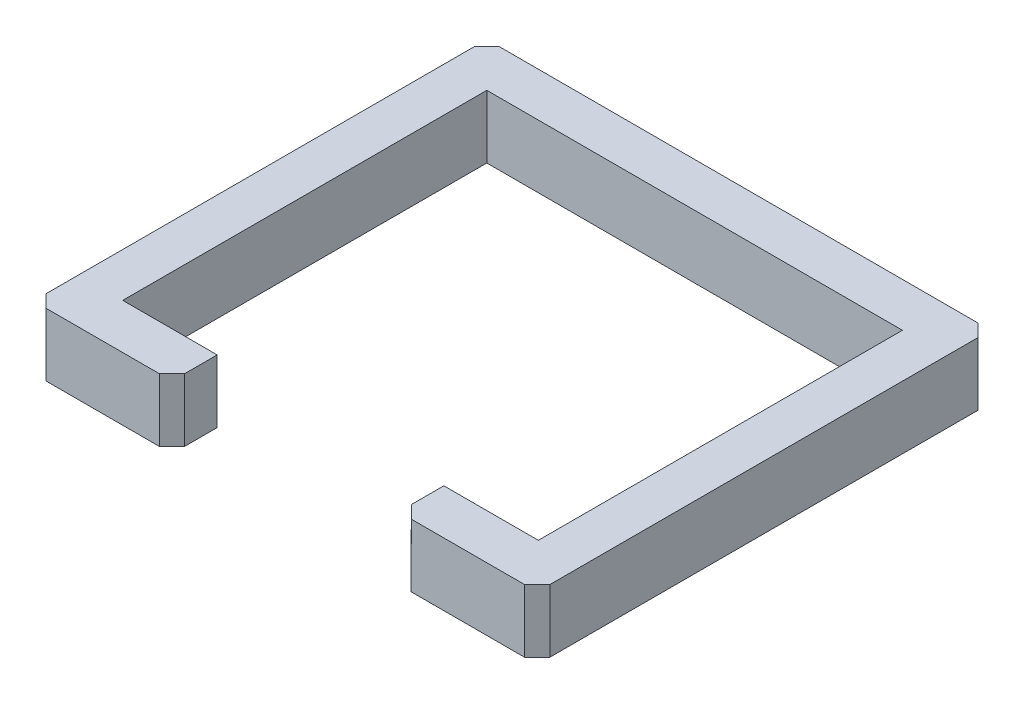
ISO-10303-21;
HEADER;
FILE_DESCRIPTION(('STEP AP214'),'2;1');
FILE_NAME('part.step','',(''),(''),'','','');
FILE_SCHEMA(('AUTOMOTIVE_DESIGN { 1 0 10303 214 1 1 1 1 }'));
ENDSEC;
DATA;
#1=APPLICATION_CONTEXT('core data for automotive mechanical design processes');
#2=APPLICATION_PROTOCOL_DEFINITION('international standard','automotive_design',2000,#1);
#3=PRODUCT_CONTEXT('',#1,'mechanical');
#4=PRODUCT('Part','Part','',(#3));
#5=PRODUCT_RELATED_PRODUCT_CATEGORY('part','',(#4));
#6=PRODUCT_DEFINITION_FORMATION('','',#4);
#7=PRODUCT_DEFINITION_CONTEXT('part definition',#1,'design');
#8=PRODUCT_DEFINITION('design','',#6,#7);
#9=PRODUCT_DEFINITION_SHAPE('','',#8);
#10=(LENGTH_UNIT() NAMED_UNIT(*) SI_UNIT(.MILLI.,.METRE.));
#11=(NAMED_UNIT(*) PLANE_ANGLE_UNIT() SI_UNIT($,.RADIAN.));
#12=(NAMED_UNIT(*) SI_UNIT($,.STERADIAN.) SOLID_ANGLE_UNIT());
#13=UNCERTAINTY_MEASURE_WITH_UNIT(LENGTH_MEASURE(1.E-05),#10,'distance_accuracy_value','');
#14=(GEOMETRIC_REPRESENTATION_CONTEXT(3) GLOBAL_UNCERTAINTY_ASSIGNED_CONTEXT((#13)) GLOBAL_UNIT_ASSIGNED_CONTEXT((#10,
#11,#12)) REPRESENTATION_CONTEXT('',''));
#15=CARTESIAN_POINT('',(0.,0.,0.));
#16=DIRECTION('',(0.,0.,1.));
#17=DIRECTION('',(1.,0.,0.));
#18=AXIS2_PLACEMENT_3D('',#15,#16,#17);
#19=CARTESIAN_POINT('',(-578.334166646118,-5.65625079123737,0.00225910678398752));
#20=DIRECTION('',(1.,0.,0.));
#21=DIRECTION('',(0.,1.,0.));
#22=AXIS2_PLACEMENT_3D('',#19,#20,#21);
#23=PLANE('',#22);
#24=DIRECTION('',(0.,-0.000399400007389268,-0.999999920239814));
#25=VECTOR('',#24,1.);
#26=CARTESIAN_POINT('',(-578.334166646117,121.343739079219,-0.0484646941544492));
#27=LINE('',#26,#25);
#28=CARTESIAN_POINT('',(-578.33416664612,121.524498547086,452.529026807354));
#29=VERTEX_POINT('',#28);
#30=CARTESIAN_POINT('',(-578.334166646114,121.179576673194,-411.070973192647));
#31=VERTEX_POINT('',#30);
#32=EDGE_CURVE('E193',#29,#31,#27,.T.);
#33=ORIENTED_EDGE('',*,*,#32,.T.);
#34=DIRECTION('',(0.,0.999999920239814,-0.000399400007389266));
#35=VECTOR('',#34,1.);
#36=CARTESIAN_POINT('',(-578.334166646115,-5.82041319726245,-411.020249391708));
#37=LINE('',#36,#35);
#38=CARTESIAN_POINT('',(-578.334166646115,-5.82041319726245,-411.020249391708));
#39=VERTEX_POINT('',#38);
#40=EDGE_CURVE('E11',#39,#31,#37,.T.);
#41=ORIENTED_EDGE('',*,*,#40,.F.);
#42=DIRECTION('',(0.,-0.000399400007389268,-0.999999920239814));
#43=VECTOR('',#42,1.);
#44=CARTESIAN_POINT('',(-578.334166646118,-5.65625079123737,0.00225910678398752));
#45=LINE('',#44,#43);
#46=CARTESIAN_POINT('',(-578.334166646121,-5.47549132337004,452.579750608292));
#47=VERTEX_POINT('',#46);
#48=EDGE_CURVE('E236',#47,#39,#45,.T.);
#49=ORIENTED_EDGE('',*,*,#48,.F.);
#50=DIRECTION('',(0.,0.999999920239814,-0.000399400007389266));
#51=VECTOR('',#50,1.);
#52=CARTESIAN_POINT('',(-578.334166646121,-5.47549132337004,452.579750608292));
#53=LINE('',#52,#51);
#54=EDGE_CURVE('E51',#47,#29,#53,.T.);
#55=ORIENTED_EDGE('',*,*,#54,.T.);
#56=EDGE_LOOP('',(#33,#41,#49,#55));
#57=FACE_BOUND('',#56,.T.);
#58=ADVANCED_FACE('F35',(#57),#23,.F.);
#59=CARTESIAN_POINT('',(-494.678377027939,-5.85382532291993,-494.676039009883));
#60=DIRECTION('',(0.707106809386026,0.000282418442360628,0.707106696588102));
#61=DIRECTION('',(0.707106724787581,0.,-0.70710683758551));
#62=AXIS2_PLACEMENT_3D('',#59,#60,#61);
#63=PLANE('',#62);
#64=DIRECTION('',(0.707106752987068,-0.000282418464901185,-0.707106752987055));
#65=VECTOR('',#64,1.);
#66=CARTESIAN_POINT('',(-494.678377027937,121.146164547536,-494.726762810822));
#67=LINE('',#66,#65);
#68=CARTESIAN_POINT('',(-552.934166646114,121.169431912197,-436.470973192646));
#69=VERTEX_POINT('',#68);
#70=EDGE_CURVE('E195',#31,#69,#67,.T.);
#71=ORIENTED_EDGE('',*,*,#70,.T.);
#72=DIRECTION('',(0.,0.999999920239814,-0.000399400007389266));
#73=VECTOR('',#72,1.);
#74=CARTESIAN_POINT('',(-552.934166646115,-5.83055795825956,-436.420249391708));
#75=LINE('',#74,#73);
#76=CARTESIAN_POINT('',(-552.934166646115,-5.83055795825956,-436.420249391708));
#77=VERTEX_POINT('',#76);
#78=EDGE_CURVE('E43',#77,#69,#75,.T.);
#79=ORIENTED_EDGE('',*,*,#78,.F.);
#80=DIRECTION('',(0.707106752987068,-0.000282418464901185,-0.707106752987055));
#81=VECTOR('',#80,1.);
#82=CARTESIAN_POINT('',(-494.678377027939,-5.85382532291993,-494.676039009883));
#83=LINE('',#82,#81);
#84=EDGE_CURVE('E120',#39,#77,#83,.T.);
#85=ORIENTED_EDGE('',*,*,#84,.F.);
#86=ORIENTED_EDGE('',*,*,#40,.T.);
#87=EDGE_LOOP('',(#71,#79,#85,#86));
#88=FACE_BOUND('',#87,.T.);
#89=ADVANCED_FACE('F330',(#88),#63,.F.);
#90=CARTESIAN_POINT('',(3.00094908815977E-12,-5.83055795826534,-436.420249391704));
#91=DIRECTION('',(0.,0.000399400007389266,0.999999920239814));
#92=DIRECTION('',(0.,-0.999999920239814,0.000399400007389266));
#93=AXIS2_PLACEMENT_3D('',#90,#91,#92);
#94=PLANE('',#93);
#95=DIRECTION('',(1.,0.,0.));
#96=VECTOR('',#95,1.);
#97=CARTESIAN_POINT('',(4.33120337215767E-12,121.169431912191,-436.470973192642));
#98=LINE('',#97,#96);
#99=CARTESIAN_POINT('',(412.265833353886,121.169431912187,-436.47097319264));
#100=VERTEX_POINT('',#99);
#101=EDGE_CURVE('E197',#69,#100,#98,.T.);
#102=ORIENTED_EDGE('',*,*,#101,.T.);
#103=DIRECTION('',(0.,0.999999920239814,-0.000399400007389266));
#104=VECTOR('',#103,1.);
#105=CARTESIAN_POINT('',(412.265833353885,-5.83055795826966,-436.420249391701));
#106=LINE('',#105,#104);
#107=CARTESIAN_POINT('',(412.265833353885,-5.83055795826966,-436.420249391701));
#108=VERTEX_POINT('',#107);
#109=EDGE_CURVE('E268',#108,#100,#106,.T.);
#110=ORIENTED_EDGE('',*,*,#109,.F.);
#111=DIRECTION('',(1.,0.,0.));
#112=VECTOR('',#111,1.);
#113=CARTESIAN_POINT('',(3.00094908815977E-12,-5.83055795826534,-436.420249391704));
#114=LINE('',#113,#112);
#115=EDGE_CURVE('E275',#77,#108,#114,.T.);
#116=ORIENTED_EDGE('',*,*,#115,.F.);
#117=ORIENTED_EDGE('',*,*,#78,.T.);
#118=EDGE_LOOP('',(#102,#110,#116,#117));
#119=FACE_BOUND('',#118,.T.);
#120=ADVANCED_FACE('F273',(#119),#94,.F.);
#121=CARTESIAN_POINT('',(424.344204771961,-5.82573385625138,-424.341877973625));
#122=DIRECTION('',(0.707106809386037,-0.000282418442375437,-0.707106696588091));
#123=DIRECTION('',(-0.70710672478757,0.,-0.707106837585521));
#124=AXIS2_PLACEMENT_3D('',#121,#122,#123);
#125=PLANE('',#124);
#126=DIRECTION('',(-0.707106752987057,-0.00028241846488638,-0.707106752987066));
#127=VECTOR('',#126,1.);
#128=CARTESIAN_POINT('',(424.344204771962,121.174256014205,-424.392601774563));
#129=LINE('',#128,#127);
#130=CARTESIAN_POINT('',(437.665833353886,121.179576673183,-411.070973192639));
#131=VERTEX_POINT('',#130);
#132=EDGE_CURVE('E200',#131,#100,#129,.T.);
#133=ORIENTED_EDGE('',*,*,#132,.F.);
#134=DIRECTION('',(0.,0.999999920239814,-0.000399400007389266));
#135=VECTOR('',#134,1.);
#136=CARTESIAN_POINT('',(437.665833353885,-5.82041319727308,-411.020249391701));
#137=LINE('',#136,#135);
#138=CARTESIAN_POINT('',(437.665833353885,-5.82041319727308,-411.020249391701));
#139=VERTEX_POINT('',#138);
#140=EDGE_CURVE('E266',#139,#131,#137,.T.);
#141=ORIENTED_EDGE('',*,*,#140,.F.);
#142=DIRECTION('',(-0.707106752987057,-0.00028241846488638,-0.707106752987066));
#143=VECTOR('',#142,1.);
#144=CARTESIAN_POINT('',(424.344204771961,-5.82573385625138,-424.341877973625));
#145=LINE('',#144,#143);
#146=EDGE_CURVE('E285',#139,#108,#145,.T.);
#147=ORIENTED_EDGE('',*,*,#146,.T.);
#148=ORIENTED_EDGE('',*,*,#109,.T.);
#149=EDGE_LOOP('',(#133,#141,#147,#148));
#150=FACE_BOUND('',#149,.T.);
#151=ADVANCED_FACE('F281',(#150),#125,.T.);
#152=CARTESIAN_POINT('',(437.665833353882,-5.65625079124801,0.00225910679096055));
#153=DIRECTION('',(-1.,0.,0.));
#154=DIRECTION('',(0.,-1.,0.));
#155=AXIS2_PLACEMENT_3D('',#152,#153,#154);
#156=PLANE('',#155);
#157=DIRECTION('',(0.,0.000399400007389268,0.999999920239814));
#158=VECTOR('',#157,1.);
#159=CARTESIAN_POINT('',(437.665833353883,121.343739079208,-0.0484646941474762));
#160=LINE('',#159,#158);
#161=CARTESIAN_POINT('',(437.66583335388,121.524498547076,452.529026807361));
#162=VERTEX_POINT('',#161);
#163=EDGE_CURVE('E203',#131,#162,#160,.T.);
#164=ORIENTED_EDGE('',*,*,#163,.T.);
#165=DIRECTION('',(0.,0.999999920239814,-0.000399400007389266));
#166=VECTOR('',#165,1.);
#167=CARTESIAN_POINT('',(437.665833353879,-5.47549132338068,452.579750608299));
#168=LINE('',#167,#166);
#169=CARTESIAN_POINT('',(437.665833353879,-5.47549132338068,452.579750608299));
#170=VERTEX_POINT('',#169);
#171=EDGE_CURVE('E264',#170,#162,#168,.T.);
#172=ORIENTED_EDGE('',*,*,#171,.F.);
#173=DIRECTION('',(0.,0.000399400007389268,0.999999920239814));
#174=VECTOR('',#173,1.);
#175=CARTESIAN_POINT('',(437.665833353882,-5.65625079124801,0.00225910679096055));
#176=LINE('',#175,#174);
#177=EDGE_CURVE('E286',#139,#170,#176,.T.);
#178=ORIENTED_EDGE('',*,*,#177,.F.);
#179=ORIENTED_EDGE('',*,*,#140,.T.);
#180=EDGE_LOOP('',(#164,#172,#178,#179));
#181=FACE_BOUND('',#180,.T.);
#182=ADVANCED_FACE('F343',(#181),#156,.F.);
#183=CARTESIAN_POINT('',(445.12169793068,-5.47846919598535,445.123886031498));
#184=DIRECTION('',(0.707106809386028,0.000282418442360627,0.7071066965881));
#185=DIRECTION('',(0.707106724787579,0.,-0.707106837585511));
#186=AXIS2_PLACEMENT_3D('',#183,#184,#185);
#187=PLANE('',#186);
#188=DIRECTION('',(0.707106752987066,-0.000282418464901186,-0.707106752987057));
#189=VECTOR('',#188,1.);
#190=CARTESIAN_POINT('',(445.121697930682,121.521520674471,445.07316223056));
#191=LINE('',#190,#189);
#192=CARTESIAN_POINT('',(412.26583335388,121.534643308073,477.929026807361));
#193=VERTEX_POINT('',#192);
#194=EDGE_CURVE('E206',#193,#162,#191,.T.);
#195=ORIENTED_EDGE('',*,*,#194,.F.);
#196=DIRECTION('',(0.,0.999999920239814,-0.000399400007389266));
#197=VECTOR('',#196,1.);
#198=CARTESIAN_POINT('',(412.265833353879,-5.46534656238358,477.979750608299));
#199=LINE('',#198,#197);
#200=CARTESIAN_POINT('',(412.265833353879,-5.46534656238358,477.979750608299));
#201=VERTEX_POINT('',#200);
#202=EDGE_CURVE('E262',#201,#193,#199,.T.);
#203=ORIENTED_EDGE('',*,*,#202,.F.);
#204=DIRECTION('',(0.707106752987066,-0.000282418464901186,-0.707106752987057));
#205=VECTOR('',#204,1.);
#206=CARTESIAN_POINT('',(445.12169793068,-5.47846919598535,445.123886031498));
#207=LINE('',#206,#205);
#208=EDGE_CURVE('E288',#201,#170,#207,.T.);
#209=ORIENTED_EDGE('',*,*,#208,.T.);
#210=ORIENTED_EDGE('',*,*,#171,.T.);
#211=EDGE_LOOP('',(#195,#203,#209,#210));
#212=FACE_BOUND('',#211,.T.);
#213=ADVANCED_FACE('F346',(#212),#187,.T.);
#214=CARTESIAN_POINT('',(-3.30729633089266E-12,-5.46534656237926,477.979750608296));
#215=DIRECTION('',(0.,-0.000399400007389266,-0.999999920239814));
#216=DIRECTION('',(0.,0.999999920239814,-0.000399400007389266));
#217=AXIS2_PLACEMENT_3D('',#214,#215,#216);
#218=PLANE('',#217);
#219=DIRECTION('',(-1.,0.,0.));
#220=VECTOR('',#219,1.);
#221=CARTESIAN_POINT('',(-1.97704204689477E-12,121.534643308077,477.929026807358));
#222=LINE('',#221,#220);
#223=CARTESIAN_POINT('',(183.66583335388,121.534643308075,477.929026807359));
#224=VERTEX_POINT('',#223);
#225=EDGE_CURVE('E209',#193,#224,#222,.T.);
#226=ORIENTED_EDGE('',*,*,#225,.T.);
#227=DIRECTION('',(0.,0.999999920239814,-0.000399400007389266));
#228=VECTOR('',#227,1.);
#229=CARTESIAN_POINT('',(183.665833353879,-5.46534656238118,477.979750608297));
#230=LINE('',#229,#228);
#231=CARTESIAN_POINT('',(183.665833353879,-5.46534656238118,477.979750608297));
#232=VERTEX_POINT('',#231);
#233=EDGE_CURVE('E260',#232,#224,#230,.T.);
#234=ORIENTED_EDGE('',*,*,#233,.F.);
#235=DIRECTION('',(-1.,0.,0.));
#236=VECTOR('',#235,1.);
#237=CARTESIAN_POINT('',(-3.30729633089266E-12,-5.46534656237926,477.979750608296));
#238=LINE('',#237,#236);
#239=EDGE_CURVE('E295',#201,#232,#238,.T.);
#240=ORIENTED_EDGE('',*,*,#239,.F.);
#241=ORIENTED_EDGE('',*,*,#202,.T.);
#242=EDGE_LOOP('',(#226,#234,#240,#241));
#243=FACE_BOUND('',#242,.T.);
#244=ADVANCED_FACE('F350',(#243),#218,.F.);
#245=CARTESIAN_POINT('',(-147.155840810991,-5.59747675202243,147.158076443423));
#246=DIRECTION('',(-0.707106809386038,0.000282418442375436,0.70710669658809));
#247=DIRECTION('',(0.707106724787569,0.,0.707106837585522));
#248=AXIS2_PLACEMENT_3D('',#245,#246,#247);
#249=PLANE('',#248);
#250=DIRECTION('',(0.707106752987056,0.000282418464886381,0.707106752987067));
#251=VECTOR('',#250,1.);
#252=CARTESIAN_POINT('',(-147.155840810989,121.402513118434,147.107352642484));
#253=LINE('',#252,#251);
#254=CARTESIAN_POINT('',(158.26583335388,121.524498547079,452.529026807359));
#255=VERTEX_POINT('',#254);
#256=EDGE_CURVE('E212',#255,#224,#253,.T.);
#257=ORIENTED_EDGE('',*,*,#256,.F.);
#258=DIRECTION('',(0.,0.999999920239814,-0.000399400007389266));
#259=VECTOR('',#258,1.);
#260=CARTESIAN_POINT('',(158.265833353879,-5.47549132337775,452.579750608297));
#261=LINE('',#260,#259);
#262=CARTESIAN_POINT('',(158.265833353879,-5.47549132337775,452.579750608297));
#263=VERTEX_POINT('',#262);
#264=EDGE_CURVE('E258',#263,#255,#261,.T.);
#265=ORIENTED_EDGE('',*,*,#264,.F.);
#266=DIRECTION('',(0.707106752987056,0.000282418464886381,0.707106752987067));
#267=VECTOR('',#266,1.);
#268=CARTESIAN_POINT('',(-147.155840810991,-5.59747675202243,147.158076443423));
#269=LINE('',#268,#267);
#270=EDGE_CURVE('E297',#263,#232,#269,.T.);
#271=ORIENTED_EDGE('',*,*,#270,.T.);
#272=ORIENTED_EDGE('',*,*,#233,.T.);
#273=EDGE_LOOP('',(#257,#265,#271,#272));
#274=FACE_BOUND('',#273,.T.);
#275=ADVANCED_FACE('F354',(#274),#249,.T.);
#276=CARTESIAN_POINT('',(158.265833353882,-5.65625079124508,0.00225910678907413));
#277=DIRECTION('',(1.,0.,0.));
#278=DIRECTION('',(0.,1.,0.));
#279=AXIS2_PLACEMENT_3D('',#276,#277,#278);
#280=PLANE('',#279);
#281=DIRECTION('',(0.,-0.000399400007389268,-0.999999920239814));
#282=VECTOR('',#281,1.);
#283=CARTESIAN_POINT('',(158.265833353883,121.343739079211,-0.0484646941493626));
#284=LINE('',#283,#282);
#285=CARTESIAN_POINT('',(158.265833353881,121.498231059836,386.761664110115));
#286=VERTEX_POINT('',#285);
#287=EDGE_CURVE('E215',#255,#286,#284,.T.);
#288=ORIENTED_EDGE('',*,*,#287,.T.);
#289=DIRECTION('',(0.,0.999999920239814,-0.000399400007389266));
#290=VECTOR('',#289,1.);
#291=CARTESIAN_POINT('',(158.265833353879,-5.50175881062011,386.812387911054));
#292=LINE('',#291,#290);
#293=CARTESIAN_POINT('',(158.265833353879,-5.50175881062011,386.812387911054));
#294=VERTEX_POINT('',#293);
#295=EDGE_CURVE('E255',#294,#286,#292,.T.);
#296=ORIENTED_EDGE('',*,*,#295,.F.);
#297=DIRECTION('',(0.,-0.000399400007389268,-0.999999920239814));
#298=VECTOR('',#297,1.);
#299=CARTESIAN_POINT('',(158.265833353882,-5.65625079124508,0.00225910678907413));
#300=LINE('',#299,#298);
#301=EDGE_CURVE('E300',#263,#294,#300,.T.);
#302=ORIENTED_EDGE('',*,*,#301,.F.);
#303=ORIENTED_EDGE('',*,*,#264,.T.);
#304=EDGE_LOOP('',(#288,#296,#302,#303));
#305=FACE_BOUND('',#304,.T.);
#306=ADVANCED_FACE('F358',(#305),#280,.F.);
#307=CARTESIAN_POINT('',(-2.7629472406475E-12,-5.50175881061846,386.812387911052));
#308=DIRECTION('',(0.,0.000399400007389266,0.999999920239814));
#309=DIRECTION('',(0.,-0.999999920239814,0.000399400007389266));
#310=AXIS2_PLACEMENT_3D('',#307,#308,#309);
#311=PLANE('',#310);
#312=DIRECTION('',(1.,0.,0.));
#313=VECTOR('',#312,1.);
#314=CARTESIAN_POINT('',(-1.43269295664961E-12,121.498231059838,386.761664110114));
#315=LINE('',#314,#313);
#316=CARTESIAN_POINT('',(348.765833353881,121.498231059834,386.761664110117));
#317=VERTEX_POINT('',#316);
#318=EDGE_CURVE('E217',#286,#317,#315,.T.);
#319=ORIENTED_EDGE('',*,*,#318,.T.);
#320=DIRECTION('',(0.,0.999999920239814,-0.000399400007389266));
#321=VECTOR('',#320,1.);
#322=CARTESIAN_POINT('',(348.765833353879,-5.50175881062209,386.812387911055));
#323=LINE('',#322,#321);
#324=CARTESIAN_POINT('',(348.765833353879,-5.50175881062209,386.812387911055));
#325=VERTEX_POINT('',#324);
#326=EDGE_CURVE('E252',#325,#317,#323,.T.);
#327=ORIENTED_EDGE('',*,*,#326,.F.);
#328=DIRECTION('',(1.,0.,0.));
#329=VECTOR('',#328,1.);
#330=CARTESIAN_POINT('',(-2.7629472406475E-12,-5.50175881061846,386.812387911052));
#331=LINE('',#330,#329);
#332=EDGE_CURVE('E302',#294,#325,#331,.T.);
#333=ORIENTED_EDGE('',*,*,#332,.F.);
#334=ORIENTED_EDGE('',*,*,#295,.T.);
#335=EDGE_LOOP('',(#319,#327,#333,#334));
#336=FACE_BOUND('',#335,.T.);
#337=ADVANCED_FACE('F362',(#336),#311,.F.);
#338=CARTESIAN_POINT('',(348.765833353882,-5.65625079124707,0.0022591067904318));
#339=DIRECTION('',(1.,0.,0.));
#340=DIRECTION('',(0.,1.,0.));
#341=AXIS2_PLACEMENT_3D('',#338,#339,#340);
#342=PLANE('',#341);
#343=DIRECTION('',(0.,-0.000399400007389268,-0.999999920239814));
#344=VECTOR('',#343,1.);
#345=CARTESIAN_POINT('',(348.765833353883,121.343739079209,-0.0484646941480049));
#346=LINE('',#345,#344);
#347=CARTESIAN_POINT('',(348.765833353886,121.204938575676,-347.57097319264));
#348=VERTEX_POINT('',#347);
#349=EDGE_CURVE('E219',#317,#348,#346,.T.);
#350=ORIENTED_EDGE('',*,*,#349,.T.);
#351=DIRECTION('',(0.,0.999999920239814,-0.000399400007389266));
#352=VECTOR('',#351,1.);
#353=CARTESIAN_POINT('',(348.765833353884,-5.79505129478006,-347.520249391702));
#354=LINE('',#353,#352);
#355=CARTESIAN_POINT('',(348.765833353884,-5.79505129478006,-347.520249391702));
#356=VERTEX_POINT('',#355);
#357=EDGE_CURVE('E249',#356,#348,#354,.T.);
#358=ORIENTED_EDGE('',*,*,#357,.F.);
#359=DIRECTION('',(0.,-0.000399400007389268,-0.999999920239814));
#360=VECTOR('',#359,1.);
#361=CARTESIAN_POINT('',(348.765833353882,-5.65625079124707,0.0022591067904318));
#362=LINE('',#361,#360);
#363=EDGE_CURVE('E304',#325,#356,#362,.T.);
#364=ORIENTED_EDGE('',*,*,#363,.F.);
#365=ORIENTED_EDGE('',*,*,#326,.T.);
#366=EDGE_LOOP('',(#350,#358,#364,#365));
#367=FACE_BOUND('',#366,.T.);
#368=ADVANCED_FACE('F366',(#367),#342,.F.);
#369=CARTESIAN_POINT('',(2.35574738117381E-12,-5.79505129477642,-347.520249391704));
#370=DIRECTION('',(0.,-0.000399400007389266,-0.999999920239814));
#371=DIRECTION('',(0.,0.999999920239814,-0.000399400007389266));
#372=AXIS2_PLACEMENT_3D('',#369,#370,#371);
#373=PLANE('',#372);
#374=DIRECTION('',(-1.,0.,0.));
#375=VECTOR('',#374,1.);
#376=CARTESIAN_POINT('',(3.68600166517171E-12,121.20493857568,-347.570973192642));
#377=LINE('',#376,#375);
#378=CARTESIAN_POINT('',(-489.434166646114,121.204938575685,-347.570973192646));
#379=VERTEX_POINT('',#378);
#380=EDGE_CURVE('E221',#348,#379,#377,.T.);
#381=ORIENTED_EDGE('',*,*,#380,.T.);
#382=DIRECTION('',(0.,0.999999920239814,-0.000399400007389266));
#383=VECTOR('',#382,1.);
#384=CARTESIAN_POINT('',(-489.434166646116,-5.79505129477129,-347.520249391707));
#385=LINE('',#384,#383);
#386=CARTESIAN_POINT('',(-489.434166646116,-5.79505129477129,-347.520249391707));
#387=VERTEX_POINT('',#386);
#388=EDGE_CURVE('E246',#387,#379,#385,.T.);
#389=ORIENTED_EDGE('',*,*,#388,.F.);
#390=DIRECTION('',(-1.,0.,0.));
#391=VECTOR('',#390,1.);
#392=CARTESIAN_POINT('',(2.35574738117381E-12,-5.79505129477642,-347.520249391704));
#393=LINE('',#392,#391);
#394=EDGE_CURVE('E306',#356,#387,#393,.T.);
#395=ORIENTED_EDGE('',*,*,#394,.F.);
#396=ORIENTED_EDGE('',*,*,#357,.T.);
#397=EDGE_LOOP('',(#381,#389,#395,#396));
#398=FACE_BOUND('',#397,.T.);
#399=ADVANCED_FACE('F370',(#398),#373,.F.);
#400=CARTESIAN_POINT('',(-489.434166646118,-5.6562507912383,0.0022591067846359));
#401=DIRECTION('',(-1.,0.,0.));
#402=DIRECTION('',(0.,-1.,0.));
#403=AXIS2_PLACEMENT_3D('',#400,#401,#402);
#404=PLANE('',#403);
#405=DIRECTION('',(0.,0.000399400007389268,0.999999920239814));
#406=VECTOR('',#405,1.);
#407=CARTESIAN_POINT('',(-489.434166646117,121.343739079218,-0.0484646941538008));
#408=LINE('',#407,#406);
#409=CARTESIAN_POINT('',(-489.434166646119,121.498231059843,386.761664110111));
#410=VERTEX_POINT('',#409);
#411=EDGE_CURVE('E223',#379,#410,#408,.T.);
#412=ORIENTED_EDGE('',*,*,#411,.T.);
#413=DIRECTION('',(0.,0.999999920239814,-0.000399400007389266));
#414=VECTOR('',#413,1.);
#415=CARTESIAN_POINT('',(-489.434166646121,-5.50175881061332,386.812387911049));
#416=LINE('',#415,#414);
#417=CARTESIAN_POINT('',(-489.434166646121,-5.50175881061332,386.812387911049));
#418=VERTEX_POINT('',#417);
#419=EDGE_CURVE('E243',#418,#410,#416,.T.);
#420=ORIENTED_EDGE('',*,*,#419,.F.);
#421=DIRECTION('',(0.,0.000399400007389268,0.999999920239814));
#422=VECTOR('',#421,1.);
#423=CARTESIAN_POINT('',(-489.434166646118,-5.6562507912383,0.0022591067846359));
#424=LINE('',#423,#422);
#425=EDGE_CURVE('E308',#387,#418,#424,.T.);
#426=ORIENTED_EDGE('',*,*,#425,.F.);
#427=ORIENTED_EDGE('',*,*,#388,.T.);
#428=EDGE_LOOP('',(#412,#420,#426,#427));
#429=FACE_BOUND('',#428,.T.);
#430=ADVANCED_FACE('F374',(#429),#404,.F.);
#431=CARTESIAN_POINT('',(-2.65023751070329E-12,-5.50175881061846,386.812387911053));
#432=DIRECTION('',(0.,0.000399400007389266,0.999999920239814));
#433=DIRECTION('',(0.,-0.999999920239814,0.000399400007389266));
#434=AXIS2_PLACEMENT_3D('',#431,#432,#433);
#435=PLANE('',#434);
#436=DIRECTION('',(1.,0.,0.));
#437=VECTOR('',#436,1.);
#438=CARTESIAN_POINT('',(-1.31998322670539E-12,121.498231059838,386.761664110114));
#439=LINE('',#438,#437);
#440=CARTESIAN_POINT('',(-298.934166646119,121.498231059841,386.761664110112));
#441=VERTEX_POINT('',#440);
#442=EDGE_CURVE('E225',#410,#441,#439,.T.);
#443=ORIENTED_EDGE('',*,*,#442,.T.);
#444=DIRECTION('',(0.,0.999999920239814,-0.000399400007389266));
#445=VECTOR('',#444,1.);
#446=CARTESIAN_POINT('',(-298.934166646121,-5.50175881061532,386.812387911051));
#447=LINE('',#446,#445);
#448=CARTESIAN_POINT('',(-298.934166646121,-5.50175881061532,386.812387911051));
#449=VERTEX_POINT('',#448);
#450=EDGE_CURVE('E240',#449,#441,#447,.T.);
#451=ORIENTED_EDGE('',*,*,#450,.F.);
#452=DIRECTION('',(1.,0.,0.));
#453=VECTOR('',#452,1.);
#454=CARTESIAN_POINT('',(-2.65023751070329E-12,-5.50175881061846,386.812387911053));
#455=LINE('',#454,#453);
#456=EDGE_CURVE('E188',#418,#449,#455,.T.);
#457=ORIENTED_EDGE('',*,*,#456,.F.);
#458=ORIENTED_EDGE('',*,*,#419,.T.);
#459=EDGE_LOOP('',(#443,#451,#457,#458));
#460=FACE_BOUND('',#459,.T.);
#461=ADVANCED_FACE('F314',(#460),#435,.F.);
#462=CARTESIAN_POINT('',(-298.934166646118,-5.6562507912403,0.00225910678598501));
#463=DIRECTION('',(-1.,0.,0.));
#464=DIRECTION('',(0.,-1.,0.));
#465=AXIS2_PLACEMENT_3D('',#462,#463,#464);
#466=PLANE('',#465);
#467=DIRECTION('',(0.,0.000399400007389268,0.999999920239814));
#468=VECTOR('',#467,1.);
#469=CARTESIAN_POINT('',(-298.934166646117,121.343739079216,-0.0484646941524517));
#470=LINE('',#469,#468);
#471=CARTESIAN_POINT('',(-298.93416664612,121.524498547083,452.529026807356));
#472=VERTEX_POINT('',#471);
#473=EDGE_CURVE('E227',#441,#472,#470,.T.);
#474=ORIENTED_EDGE('',*,*,#473,.T.);
#475=DIRECTION('',(0.,0.999999920239814,-0.000399400007389266));
#476=VECTOR('',#475,1.);
#477=CARTESIAN_POINT('',(-298.934166646121,-5.47549132337297,452.579750608294));
#478=LINE('',#477,#476);
#479=CARTESIAN_POINT('',(-298.934166646121,-5.47549132337297,452.579750608294));
#480=VERTEX_POINT('',#479);
#481=EDGE_CURVE('E175',#480,#472,#478,.T.);
#482=ORIENTED_EDGE('',*,*,#481,.F.);
#483=DIRECTION('',(0.,0.000399400007389268,0.999999920239814));
#484=VECTOR('',#483,1.);
#485=CARTESIAN_POINT('',(-298.934166646118,-5.6562507912403,0.00225910678598501));
#486=LINE('',#485,#484);
#487=EDGE_CURVE('E185',#449,#480,#486,.T.);
#488=ORIENTED_EDGE('',*,*,#487,.F.);
#489=ORIENTED_EDGE('',*,*,#450,.T.);
#490=EDGE_LOOP('',(#474,#482,#488,#489));
#491=FACE_BOUND('',#490,.T.);
#492=ADVANCED_FACE('F318',(#491),#466,.F.);
#493=CARTESIAN_POINT('',(76.8216685550054,-5.62556821870296,76.8239154071741));
#494=DIRECTION('',(0.707106809386026,0.000282418442360628,0.707106696588102));
#495=DIRECTION('',(0.707106724787581,0.,-0.70710683758551));
#496=AXIS2_PLACEMENT_3D('',#493,#494,#495);
#497=PLANE('',#496);
#498=DIRECTION('',(0.707106752987068,-0.000282418464901185,-0.707106752987055));
#499=VECTOR('',#498,1.);
#500=CARTESIAN_POINT('',(76.8216685550067,121.374421651753,76.7731916062357));
#501=LINE('',#500,#499);
#502=CARTESIAN_POINT('',(-324.33416664612,121.534643308081,477.929026807355));
#503=VERTEX_POINT('',#502);
#504=EDGE_CURVE('E172',#503,#472,#501,.T.);
#505=ORIENTED_EDGE('',*,*,#504,.F.);
#506=DIRECTION('',(0.,0.999999920239814,-0.000399400007389266));
#507=VECTOR('',#506,1.);
#508=CARTESIAN_POINT('',(-324.334166646121,-5.46534656237588,477.979750608294));
#509=LINE('',#508,#507);
#510=CARTESIAN_POINT('',(-324.334166646121,-5.46534656237588,477.979750608294));
#511=VERTEX_POINT('',#510);
#512=EDGE_CURVE('E166',#511,#503,#509,.T.);
#513=ORIENTED_EDGE('',*,*,#512,.F.);
#514=DIRECTION('',(0.707106752987068,-0.000282418464901185,-0.707106752987055));
#515=VECTOR('',#514,1.);
#516=CARTESIAN_POINT('',(76.8216685550054,-5.62556821870296,76.8239154071741));
#517=LINE('',#516,#515);
#518=EDGE_CURVE('E170',#511,#480,#517,.T.);
#519=ORIENTED_EDGE('',*,*,#518,.T.);
#520=ORIENTED_EDGE('',*,*,#481,.T.);
#521=EDGE_LOOP('',(#505,#513,#519,#520));
#522=FACE_BOUND('',#521,.T.);
#523=ADVANCED_FACE('F168',(#522),#497,.T.);
#524=CARTESIAN_POINT('',(-3.30729633089267E-12,-5.46534656237926,477.979750608296));
#525=DIRECTION('',(0.,-0.000399400007389266,-0.999999920239814));
#526=DIRECTION('',(0.,0.999999920239814,-0.000399400007389266));
#527=AXIS2_PLACEMENT_3D('',#524,#525,#526);
#528=PLANE('',#527);
#529=DIRECTION('',(-1.,0.,0.));
#530=VECTOR('',#529,1.);
#531=CARTESIAN_POINT('',(-1.97704204689477E-12,121.534643308077,477.929026807358));
#532=LINE('',#531,#530);
#533=CARTESIAN_POINT('',(-552.93416664612,121.534643308083,477.929026807354));
#534=VERTEX_POINT('',#533);
#535=EDGE_CURVE('E231',#503,#534,#532,.T.);
#536=ORIENTED_EDGE('',*,*,#535,.T.);
#537=DIRECTION('',(0.,0.999999920239814,-0.000399400007389266));
#538=VECTOR('',#537,1.);
#539=CARTESIAN_POINT('',(-552.934166646121,-5.46534656237348,477.979750608292));
#540=LINE('',#539,#538);
#541=CARTESIAN_POINT('',(-552.934166646121,-5.46534656237348,477.979750608292));
#542=VERTEX_POINT('',#541);
#543=EDGE_CURVE('E108',#542,#534,#540,.T.);
#544=ORIENTED_EDGE('',*,*,#543,.F.);
#545=DIRECTION('',(-1.,0.,0.));
#546=VECTOR('',#545,1.);
#547=CARTESIAN_POINT('',(-3.30729633089267E-12,-5.46534656237926,477.979750608296));
#548=LINE('',#547,#546);
#549=EDGE_CURVE('E177',#511,#542,#548,.T.);
#550=ORIENTED_EDGE('',*,*,#549,.F.);
#551=ORIENTED_EDGE('',*,*,#512,.T.);
#552=EDGE_LOOP('',(#536,#544,#550,#551));
#553=FACE_BOUND('',#552,.T.);
#554=ADVANCED_FACE('F178',(#553),#528,.F.);
#555=CARTESIAN_POINT('',(-515.455870186671,-5.4503777292971,515.458047067743));
#556=DIRECTION('',(-0.707106809386037,0.000282418442375437,0.707106696588091));
#557=DIRECTION('',(0.70710672478757,0.,0.707106837585521));
#558=AXIS2_PLACEMENT_3D('',#555,#556,#557);
#559=PLANE('',#558);
#560=DIRECTION('',(0.707106752987057,0.00028241846488638,0.707106752987066));
#561=VECTOR('',#560,1.);
#562=CARTESIAN_POINT('',(-515.45587018667,121.549612141159,515.407323266805));
#563=LINE('',#562,#561);
#564=EDGE_CURVE('E233',#29,#534,#563,.T.);
#565=ORIENTED_EDGE('',*,*,#564,.F.);
#566=ORIENTED_EDGE('',*,*,#54,.F.);
#567=DIRECTION('',(0.707106752987057,0.00028241846488638,0.707106752987066));
#568=VECTOR('',#567,1.);
#569=CARTESIAN_POINT('',(-515.455870186671,-5.4503777292971,515.458047067743));
#570=LINE('',#569,#568);
#571=EDGE_CURVE('E181',#47,#542,#570,.T.);
#572=ORIENTED_EDGE('',*,*,#571,.T.);
#573=ORIENTED_EDGE('',*,*,#543,.T.);
#574=EDGE_LOOP('',(#565,#566,#572,#573));
#575=FACE_BOUND('',#574,.T.);
#576=ADVANCED_FACE('F319',(#575),#559,.T.);
#577=CARTESIAN_POINT('',(0.,-5.65625079124343,0.0022591067880048));
#578=DIRECTION('',(0.,-0.999999920239814,0.000399400007389268));
#579=DIRECTION('',(0.,-0.000399400007389268,-0.999999920239814));
#580=AXIS2_PLACEMENT_3D('',#577,#578,#579);
#581=PLANE('',#580);
#582=ORIENTED_EDGE('',*,*,#48,.T.);
#583=ORIENTED_EDGE('',*,*,#84,.T.);
#584=ORIENTED_EDGE('',*,*,#115,.T.);
#585=ORIENTED_EDGE('',*,*,#146,.F.);
#586=ORIENTED_EDGE('',*,*,#177,.T.);
#587=ORIENTED_EDGE('',*,*,#208,.F.);
#588=ORIENTED_EDGE('',*,*,#239,.T.);
#589=ORIENTED_EDGE('',*,*,#270,.F.);
#590=ORIENTED_EDGE('',*,*,#301,.T.);
#591=ORIENTED_EDGE('',*,*,#332,.T.);
#592=ORIENTED_EDGE('',*,*,#363,.T.);
#593=ORIENTED_EDGE('',*,*,#394,.T.);
#594=ORIENTED_EDGE('',*,*,#425,.T.);
#595=ORIENTED_EDGE('',*,*,#456,.T.);
#596=ORIENTED_EDGE('',*,*,#487,.T.);
#597=ORIENTED_EDGE('',*,*,#518,.F.);
#598=ORIENTED_EDGE('',*,*,#549,.T.);
#599=ORIENTED_EDGE('',*,*,#571,.F.);
#600=EDGE_LOOP('',(#582,#583,#584,#585,#586,#587,#588,#589,#590,#591,#592,#593,#594,#595,#596,
#597,#598,#599));
#601=FACE_BOUND('',#600,.T.);
#602=ADVANCED_FACE('F183',(#601),#581,.T.);
#603=CARTESIAN_POINT('',(1.27085495091387E-12,121.343739079213,-0.0484646941504319));
#604=DIRECTION('',(0.,-0.999999920239814,0.000399400007389268));
#605=DIRECTION('',(0.,-0.000399400007389268,-0.999999920239814));
#606=AXIS2_PLACEMENT_3D('',#603,#604,#605);
#607=PLANE('',#606);
#608=ORIENTED_EDGE('',*,*,#32,.F.);
#609=ORIENTED_EDGE('',*,*,#564,.T.);
#610=ORIENTED_EDGE('',*,*,#535,.F.);
#611=ORIENTED_EDGE('',*,*,#504,.T.);
#612=ORIENTED_EDGE('',*,*,#473,.F.);
#613=ORIENTED_EDGE('',*,*,#442,.F.);
#614=ORIENTED_EDGE('',*,*,#411,.F.);
#615=ORIENTED_EDGE('',*,*,#380,.F.);
#616=ORIENTED_EDGE('',*,*,#349,.F.);
#617=ORIENTED_EDGE('',*,*,#318,.F.);
#618=ORIENTED_EDGE('',*,*,#287,.F.);
#619=ORIENTED_EDGE('',*,*,#256,.T.);
#620=ORIENTED_EDGE('',*,*,#225,.F.);
#621=ORIENTED_EDGE('',*,*,#194,.T.);
#622=ORIENTED_EDGE('',*,*,#163,.F.);
#623=ORIENTED_EDGE('',*,*,#132,.T.);
#624=ORIENTED_EDGE('',*,*,#101,.F.);
#625=ORIENTED_EDGE('',*,*,#70,.F.);
#626=EDGE_LOOP('',(#608,#609,#610,#611,#612,#613,#614,#615,#616,#617,#618,#619,#620,#621,#622,
#623,#624,#625));
#627=FACE_BOUND('',#626,.T.);
#628=ADVANCED_FACE('F277',(#627),#607,.F.);
#629=CLOSED_SHELL('',(#58,#89,#120,#151,#182,#213,#244,#275,#306,#337,#368,#399,#430,#461,#492,
#523,#554,#576,#602,#628));
#630=MANIFOLD_SOLID_BREP('B2',#629);
#631=ADVANCED_BREP_SHAPE_REPRESENTATION('',(#18,#630),#14);
#632=SHAPE_DEFINITION_REPRESENTATION(#9,#631);
ENDSEC;
END-ISO-10303-21;
